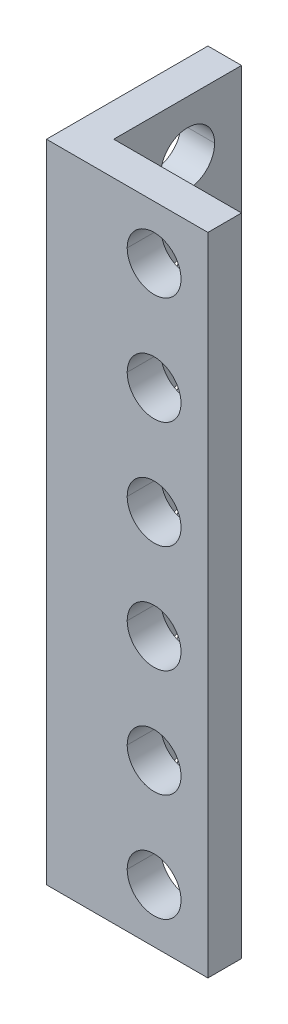
ISO-10303-21;
HEADER;
FILE_DESCRIPTION(('STEP AP214'),'2;1');
FILE_NAME('part.step','',(''),(''),'','','');
FILE_SCHEMA(('AUTOMOTIVE_DESIGN { 1 0 10303 214 1 1 1 1 }'));
ENDSEC;
DATA;
#1=APPLICATION_CONTEXT('core data for automotive mechanical design processes');
#2=APPLICATION_PROTOCOL_DEFINITION('international standard','automotive_design',2000,#1);
#3=PRODUCT_CONTEXT('',#1,'mechanical');
#4=PRODUCT('Part','Part','',(#3));
#5=PRODUCT_RELATED_PRODUCT_CATEGORY('part','',(#4));
#6=PRODUCT_DEFINITION_FORMATION('','',#4);
#7=PRODUCT_DEFINITION_CONTEXT('part definition',#1,'design');
#8=PRODUCT_DEFINITION('design','',#6,#7);
#9=PRODUCT_DEFINITION_SHAPE('','',#8);
#10=(LENGTH_UNIT() NAMED_UNIT(*) SI_UNIT(.MILLI.,.METRE.));
#11=(NAMED_UNIT(*) PLANE_ANGLE_UNIT() SI_UNIT($,.RADIAN.));
#12=(NAMED_UNIT(*) SI_UNIT($,.STERADIAN.) SOLID_ANGLE_UNIT());
#13=UNCERTAINTY_MEASURE_WITH_UNIT(LENGTH_MEASURE(1.E-05),#10,'distance_accuracy_value','');
#14=(GEOMETRIC_REPRESENTATION_CONTEXT(3) GLOBAL_UNCERTAINTY_ASSIGNED_CONTEXT((#13)) GLOBAL_UNIT_ASSIGNED_CONTEXT((#10,
#11,#12)) REPRESENTATION_CONTEXT('',''));
#15=CARTESIAN_POINT('',(0.,0.,0.));
#16=DIRECTION('',(0.,0.,1.));
#17=DIRECTION('',(1.,0.,0.));
#18=AXIS2_PLACEMENT_3D('',#15,#16,#17);
#19=CARTESIAN_POINT('',(12.,44.,-8.));
#20=DIRECTION('',(-1.,0.,0.));
#21=DIRECTION('',(0.,0.,1.));
#22=AXIS2_PLACEMENT_3D('',#19,#20,#21);
#23=CYLINDRICAL_SURFACE('',#22,2.);
#24=DIRECTION('',(-1.,0.,0.));
#25=VECTOR('',#24,1.);
#26=CARTESIAN_POINT('',(12.,44.,-10.));
#27=LINE('',#26,#25);
#28=CARTESIAN_POINT('',(2.5,44.,-10.));
#29=VERTEX_POINT('',#28);
#30=CARTESIAN_POINT('',(0.,44.,-10.));
#31=VERTEX_POINT('',#30);
#32=EDGE_CURVE('E452',#29,#31,#27,.T.);
#33=ORIENTED_EDGE('',*,*,#32,.F.);
#34=CARTESIAN_POINT('',(2.5,44.,-8.));
#35=DIRECTION('',(-1.,0.,0.));
#36=DIRECTION('',(0.,0.,1.));
#37=AXIS2_PLACEMENT_3D('',#34,#35,#36);
#38=CIRCLE('',#37,2.);
#39=CARTESIAN_POINT('',(2.5,44.,-6.));
#40=VERTEX_POINT('',#39);
#41=EDGE_CURVE('E495',#40,#29,#38,.T.);
#42=ORIENTED_EDGE('',*,*,#41,.F.);
#43=DIRECTION('',(-1.,0.,0.));
#44=VECTOR('',#43,1.);
#45=CARTESIAN_POINT('',(12.,44.,-6.));
#46=LINE('',#45,#44);
#47=CARTESIAN_POINT('',(0.,44.,-6.));
#48=VERTEX_POINT('',#47);
#49=EDGE_CURVE('E400',#40,#48,#46,.T.);
#50=ORIENTED_EDGE('',*,*,#49,.T.);
#51=CARTESIAN_POINT('',(0.,44.,-8.));
#52=DIRECTION('',(-1.,0.,0.));
#53=DIRECTION('',(0.,0.,1.));
#54=AXIS2_PLACEMENT_3D('',#51,#52,#53);
#55=CIRCLE('',#54,2.);
#56=EDGE_CURVE('E453',#48,#31,#55,.T.);
#57=ORIENTED_EDGE('',*,*,#56,.T.);
#58=EDGE_LOOP('',(#33,#42,#50,#57));
#59=FACE_BOUND('',#58,.T.);
#60=ADVANCED_FACE('F15',(#59),#23,.F.);
#61=CARTESIAN_POINT('',(12.,36.,-8.));
#62=DIRECTION('',(-1.,0.,0.));
#63=DIRECTION('',(0.,0.,1.));
#64=AXIS2_PLACEMENT_3D('',#61,#62,#63);
#65=CYLINDRICAL_SURFACE('',#64,2.);
#66=DIRECTION('',(-1.,0.,0.));
#67=VECTOR('',#66,1.);
#68=CARTESIAN_POINT('',(12.,36.,-10.));
#69=LINE('',#68,#67);
#70=CARTESIAN_POINT('',(2.5,36.,-10.));
#71=VERTEX_POINT('',#70);
#72=CARTESIAN_POINT('',(0.,36.,-10.));
#73=VERTEX_POINT('',#72);
#74=EDGE_CURVE('E382',#71,#73,#69,.T.);
#75=ORIENTED_EDGE('',*,*,#74,.F.);
#76=CARTESIAN_POINT('',(2.5,36.,-8.));
#77=DIRECTION('',(-1.,0.,0.));
#78=DIRECTION('',(0.,0.,1.));
#79=AXIS2_PLACEMENT_3D('',#76,#77,#78);
#80=CIRCLE('',#79,2.);
#81=CARTESIAN_POINT('',(2.5,36.,-6.));
#82=VERTEX_POINT('',#81);
#83=EDGE_CURVE('E492',#82,#71,#80,.T.);
#84=ORIENTED_EDGE('',*,*,#83,.F.);
#85=DIRECTION('',(-1.,0.,0.));
#86=VECTOR('',#85,1.);
#87=CARTESIAN_POINT('',(12.,36.,-6.));
#88=LINE('',#87,#86);
#89=CARTESIAN_POINT('',(0.,36.,-6.));
#90=VERTEX_POINT('',#89);
#91=EDGE_CURVE('E381',#82,#90,#88,.T.);
#92=ORIENTED_EDGE('',*,*,#91,.T.);
#93=CARTESIAN_POINT('',(0.,36.,-8.));
#94=DIRECTION('',(-1.,0.,0.));
#95=DIRECTION('',(0.,0.,1.));
#96=AXIS2_PLACEMENT_3D('',#93,#94,#95);
#97=CIRCLE('',#96,2.);
#98=EDGE_CURVE('E234',#90,#73,#97,.T.);
#99=ORIENTED_EDGE('',*,*,#98,.T.);
#100=EDGE_LOOP('',(#75,#84,#92,#99));
#101=FACE_BOUND('',#100,.T.);
#102=ADVANCED_FACE('F674',(#101),#65,.F.);
#103=CARTESIAN_POINT('',(12.,28.,-8.));
#104=DIRECTION('',(-1.,0.,0.));
#105=DIRECTION('',(0.,0.,1.));
#106=AXIS2_PLACEMENT_3D('',#103,#104,#105);
#107=CYLINDRICAL_SURFACE('',#106,2.);
#108=DIRECTION('',(-1.,0.,0.));
#109=VECTOR('',#108,1.);
#110=CARTESIAN_POINT('',(12.,28.,-10.));
#111=LINE('',#110,#109);
#112=CARTESIAN_POINT('',(2.5,28.,-10.));
#113=VERTEX_POINT('',#112);
#114=CARTESIAN_POINT('',(0.,28.,-10.));
#115=VERTEX_POINT('',#114);
#116=EDGE_CURVE('E371',#113,#115,#111,.T.);
#117=ORIENTED_EDGE('',*,*,#116,.F.);
#118=CARTESIAN_POINT('',(2.5,28.,-8.));
#119=DIRECTION('',(-1.,0.,0.));
#120=DIRECTION('',(0.,0.,1.));
#121=AXIS2_PLACEMENT_3D('',#118,#119,#120);
#122=CIRCLE('',#121,2.);
#123=CARTESIAN_POINT('',(2.5,28.,-6.));
#124=VERTEX_POINT('',#123);
#125=EDGE_CURVE('E435',#124,#113,#122,.T.);
#126=ORIENTED_EDGE('',*,*,#125,.F.);
#127=DIRECTION('',(-1.,0.,0.));
#128=VECTOR('',#127,1.);
#129=CARTESIAN_POINT('',(12.,28.,-6.));
#130=LINE('',#129,#128);
#131=CARTESIAN_POINT('',(0.,28.,-6.));
#132=VERTEX_POINT('',#131);
#133=EDGE_CURVE('E595',#124,#132,#130,.T.);
#134=ORIENTED_EDGE('',*,*,#133,.T.);
#135=CARTESIAN_POINT('',(0.,28.,-8.));
#136=DIRECTION('',(-1.,0.,0.));
#137=DIRECTION('',(0.,0.,1.));
#138=AXIS2_PLACEMENT_3D('',#135,#136,#137);
#139=CIRCLE('',#138,2.);
#140=EDGE_CURVE('E463',#132,#115,#139,.T.);
#141=ORIENTED_EDGE('',*,*,#140,.T.);
#142=EDGE_LOOP('',(#117,#126,#134,#141));
#143=FACE_BOUND('',#142,.T.);
#144=ADVANCED_FACE('F679',(#143),#107,.F.);
#145=CARTESIAN_POINT('',(12.,20.,-8.));
#146=DIRECTION('',(-1.,0.,0.));
#147=DIRECTION('',(0.,0.,1.));
#148=AXIS2_PLACEMENT_3D('',#145,#146,#147);
#149=CYLINDRICAL_SURFACE('',#148,2.);
#150=DIRECTION('',(-1.,0.,0.));
#151=VECTOR('',#150,1.);
#152=CARTESIAN_POINT('',(12.,20.,-10.));
#153=LINE('',#152,#151);
#154=CARTESIAN_POINT('',(2.5,20.,-10.));
#155=VERTEX_POINT('',#154);
#156=CARTESIAN_POINT('',(0.,20.,-10.));
#157=VERTEX_POINT('',#156);
#158=EDGE_CURVE('E594',#155,#157,#153,.T.);
#159=ORIENTED_EDGE('',*,*,#158,.F.);
#160=CARTESIAN_POINT('',(2.5,20.,-8.));
#161=DIRECTION('',(-1.,0.,0.));
#162=DIRECTION('',(0.,0.,1.));
#163=AXIS2_PLACEMENT_3D('',#160,#161,#162);
#164=CIRCLE('',#163,2.);
#165=CARTESIAN_POINT('',(2.5,20.,-6.));
#166=VERTEX_POINT('',#165);
#167=EDGE_CURVE('E432',#166,#155,#164,.T.);
#168=ORIENTED_EDGE('',*,*,#167,.F.);
#169=DIRECTION('',(-1.,0.,0.));
#170=VECTOR('',#169,1.);
#171=CARTESIAN_POINT('',(12.,20.,-6.));
#172=LINE('',#171,#170);
#173=CARTESIAN_POINT('',(0.,20.,-6.));
#174=VERTEX_POINT('',#173);
#175=EDGE_CURVE('E339',#166,#174,#172,.T.);
#176=ORIENTED_EDGE('',*,*,#175,.T.);
#177=CARTESIAN_POINT('',(0.,20.,-8.));
#178=DIRECTION('',(-1.,0.,0.));
#179=DIRECTION('',(0.,0.,1.));
#180=AXIS2_PLACEMENT_3D('',#177,#178,#179);
#181=CIRCLE('',#180,2.);
#182=EDGE_CURVE('E460',#174,#157,#181,.T.);
#183=ORIENTED_EDGE('',*,*,#182,.T.);
#184=EDGE_LOOP('',(#159,#168,#176,#183));
#185=FACE_BOUND('',#184,.T.);
#186=ADVANCED_FACE('F897',(#185),#149,.F.);
#187=CARTESIAN_POINT('',(12.,12.,-8.));
#188=DIRECTION('',(-1.,0.,0.));
#189=DIRECTION('',(0.,0.,1.));
#190=AXIS2_PLACEMENT_3D('',#187,#188,#189);
#191=CYLINDRICAL_SURFACE('',#190,2.);
#192=DIRECTION('',(-1.,0.,0.));
#193=VECTOR('',#192,1.);
#194=CARTESIAN_POINT('',(12.,12.,-10.));
#195=LINE('',#194,#193);
#196=CARTESIAN_POINT('',(2.5,12.,-10.));
#197=VERTEX_POINT('',#196);
#198=CARTESIAN_POINT('',(0.,12.,-10.));
#199=VERTEX_POINT('',#198);
#200=EDGE_CURVE('E364',#197,#199,#195,.T.);
#201=ORIENTED_EDGE('',*,*,#200,.F.);
#202=CARTESIAN_POINT('',(2.5,12.,-8.));
#203=DIRECTION('',(-1.,0.,0.));
#204=DIRECTION('',(0.,0.,1.));
#205=AXIS2_PLACEMENT_3D('',#202,#203,#204);
#206=CIRCLE('',#205,2.);
#207=CARTESIAN_POINT('',(2.5,12.,-6.));
#208=VERTEX_POINT('',#207);
#209=EDGE_CURVE('E126',#208,#197,#206,.T.);
#210=ORIENTED_EDGE('',*,*,#209,.F.);
#211=DIRECTION('',(-1.,0.,0.));
#212=VECTOR('',#211,1.);
#213=CARTESIAN_POINT('',(12.,12.,-6.));
#214=LINE('',#213,#212);
#215=CARTESIAN_POINT('',(0.,12.,-6.));
#216=VERTEX_POINT('',#215);
#217=EDGE_CURVE('E345',#208,#216,#214,.T.);
#218=ORIENTED_EDGE('',*,*,#217,.T.);
#219=CARTESIAN_POINT('',(0.,12.,-8.));
#220=DIRECTION('',(-1.,0.,0.));
#221=DIRECTION('',(0.,0.,1.));
#222=AXIS2_PLACEMENT_3D('',#219,#220,#221);
#223=CIRCLE('',#222,2.);
#224=EDGE_CURVE('E133',#216,#199,#223,.T.);
#225=ORIENTED_EDGE('',*,*,#224,.T.);
#226=EDGE_LOOP('',(#201,#210,#218,#225));
#227=FACE_BOUND('',#226,.T.);
#228=ADVANCED_FACE('F892',(#227),#191,.F.);
#229=CARTESIAN_POINT('',(8.,44.,-12.));
#230=DIRECTION('',(0.,0.,1.));
#231=DIRECTION('',(1.,0.,0.));
#232=AXIS2_PLACEMENT_3D('',#229,#230,#231);
#233=CYLINDRICAL_SURFACE('',#232,2.);
#234=DIRECTION('',(0.,0.,1.));
#235=VECTOR('',#234,1.);
#236=CARTESIAN_POINT('',(6.,44.,-12.));
#237=LINE('',#236,#235);
#238=CARTESIAN_POINT('',(6.,44.,-2.5));
#239=VERTEX_POINT('',#238);
#240=CARTESIAN_POINT('',(6.,44.,0.));
#241=VERTEX_POINT('',#240);
#242=EDGE_CURVE('E370',#239,#241,#237,.T.);
#243=ORIENTED_EDGE('',*,*,#242,.F.);
#244=CARTESIAN_POINT('',(8.,44.,-2.5));
#245=DIRECTION('',(0.,0.,1.));
#246=DIRECTION('',(-1.,0.,0.));
#247=AXIS2_PLACEMENT_3D('',#244,#245,#246);
#248=CIRCLE('',#247,2.);
#249=CARTESIAN_POINT('',(10.,44.,-2.50000000000004));
#250=VERTEX_POINT('',#249);
#251=EDGE_CURVE('E353',#250,#239,#248,.T.);
#252=ORIENTED_EDGE('',*,*,#251,.F.);
#253=DIRECTION('',(0.,0.,1.));
#254=VECTOR('',#253,1.);
#255=CARTESIAN_POINT('',(10.,44.,-12.));
#256=LINE('',#255,#254);
#257=CARTESIAN_POINT('',(10.,44.,0.));
#258=VERTEX_POINT('',#257);
#259=EDGE_CURVE('E369',#250,#258,#256,.T.);
#260=ORIENTED_EDGE('',*,*,#259,.T.);
#261=CARTESIAN_POINT('',(8.,44.,0.));
#262=DIRECTION('',(0.,0.,-1.));
#263=DIRECTION('',(-1.,0.,0.));
#264=AXIS2_PLACEMENT_3D('',#261,#262,#263);
#265=CIRCLE('',#264,2.);
#266=EDGE_CURVE('E410',#241,#258,#265,.T.);
#267=ORIENTED_EDGE('',*,*,#266,.F.);
#268=EDGE_LOOP('',(#243,#252,#260,#267));
#269=FACE_BOUND('',#268,.T.);
#270=ADVANCED_FACE('F896',(#269),#233,.F.);
#271=CARTESIAN_POINT('',(8.,36.,-12.));
#272=DIRECTION('',(0.,0.,1.));
#273=DIRECTION('',(1.,0.,0.));
#274=AXIS2_PLACEMENT_3D('',#271,#272,#273);
#275=CYLINDRICAL_SURFACE('',#274,2.);
#276=DIRECTION('',(0.,0.,1.));
#277=VECTOR('',#276,1.);
#278=CARTESIAN_POINT('',(6.,36.,-12.));
#279=LINE('',#278,#277);
#280=CARTESIAN_POINT('',(6.,36.,-2.5));
#281=VERTEX_POINT('',#280);
#282=CARTESIAN_POINT('',(6.,36.,0.));
#283=VERTEX_POINT('',#282);
#284=EDGE_CURVE('E540',#281,#283,#279,.T.);
#285=ORIENTED_EDGE('',*,*,#284,.F.);
#286=CARTESIAN_POINT('',(8.,36.,-2.5));
#287=DIRECTION('',(0.,0.,1.));
#288=DIRECTION('',(-1.,0.,0.));
#289=AXIS2_PLACEMENT_3D('',#286,#287,#288);
#290=CIRCLE('',#289,2.);
#291=CARTESIAN_POINT('',(10.,36.,-2.50000000000004));
#292=VERTEX_POINT('',#291);
#293=EDGE_CURVE('E280',#292,#281,#290,.T.);
#294=ORIENTED_EDGE('',*,*,#293,.F.);
#295=DIRECTION('',(0.,0.,1.));
#296=VECTOR('',#295,1.);
#297=CARTESIAN_POINT('',(10.,36.,-12.));
#298=LINE('',#297,#296);
#299=CARTESIAN_POINT('',(10.,36.,0.));
#300=VERTEX_POINT('',#299);
#301=EDGE_CURVE('E468',#292,#300,#298,.T.);
#302=ORIENTED_EDGE('',*,*,#301,.T.);
#303=CARTESIAN_POINT('',(8.,36.,0.));
#304=DIRECTION('',(0.,0.,-1.));
#305=DIRECTION('',(-1.,0.,0.));
#306=AXIS2_PLACEMENT_3D('',#303,#304,#305);
#307=CIRCLE('',#306,2.);
#308=EDGE_CURVE('E448',#283,#300,#307,.T.);
#309=ORIENTED_EDGE('',*,*,#308,.F.);
#310=EDGE_LOOP('',(#285,#294,#302,#309));
#311=FACE_BOUND('',#310,.T.);
#312=ADVANCED_FACE('F658',(#311),#275,.F.);
#313=CARTESIAN_POINT('',(8.,28.,-12.));
#314=DIRECTION('',(0.,0.,1.));
#315=DIRECTION('',(1.,0.,0.));
#316=AXIS2_PLACEMENT_3D('',#313,#314,#315);
#317=CYLINDRICAL_SURFACE('',#316,2.);
#318=DIRECTION('',(0.,0.,1.));
#319=VECTOR('',#318,1.);
#320=CARTESIAN_POINT('',(6.,28.,-12.));
#321=LINE('',#320,#319);
#322=CARTESIAN_POINT('',(6.,28.,-2.5));
#323=VERTEX_POINT('',#322);
#324=CARTESIAN_POINT('',(6.,28.,0.));
#325=VERTEX_POINT('',#324);
#326=EDGE_CURVE('E496',#323,#325,#321,.T.);
#327=ORIENTED_EDGE('',*,*,#326,.F.);
#328=CARTESIAN_POINT('',(8.,28.,-2.5));
#329=DIRECTION('',(0.,0.,1.));
#330=DIRECTION('',(-1.,0.,0.));
#331=AXIS2_PLACEMENT_3D('',#328,#329,#330);
#332=CIRCLE('',#331,2.);
#333=CARTESIAN_POINT('',(10.,28.,-2.50000000000004));
#334=VERTEX_POINT('',#333);
#335=EDGE_CURVE('E357',#334,#323,#332,.T.);
#336=ORIENTED_EDGE('',*,*,#335,.F.);
#337=DIRECTION('',(0.,0.,1.));
#338=VECTOR('',#337,1.);
#339=CARTESIAN_POINT('',(10.,28.,-12.));
#340=LINE('',#339,#338);
#341=CARTESIAN_POINT('',(10.,28.,0.));
#342=VERTEX_POINT('',#341);
#343=EDGE_CURVE('E418',#334,#342,#340,.T.);
#344=ORIENTED_EDGE('',*,*,#343,.T.);
#345=CARTESIAN_POINT('',(8.,28.,0.));
#346=DIRECTION('',(0.,0.,-1.));
#347=DIRECTION('',(-1.,0.,0.));
#348=AXIS2_PLACEMENT_3D('',#345,#346,#347);
#349=CIRCLE('',#348,2.);
#350=EDGE_CURVE('E456',#325,#342,#349,.T.);
#351=ORIENTED_EDGE('',*,*,#350,.F.);
#352=EDGE_LOOP('',(#327,#336,#344,#351));
#353=FACE_BOUND('',#352,.T.);
#354=ADVANCED_FACE('F556',(#353),#317,.F.);
#355=CARTESIAN_POINT('',(8.,20.,-12.));
#356=DIRECTION('',(0.,0.,1.));
#357=DIRECTION('',(1.,0.,0.));
#358=AXIS2_PLACEMENT_3D('',#355,#356,#357);
#359=CYLINDRICAL_SURFACE('',#358,2.);
#360=DIRECTION('',(0.,0.,1.));
#361=VECTOR('',#360,1.);
#362=CARTESIAN_POINT('',(6.,20.,-12.));
#363=LINE('',#362,#361);
#364=CARTESIAN_POINT('',(6.,20.,-2.5));
#365=VERTEX_POINT('',#364);
#366=CARTESIAN_POINT('',(6.,20.,0.));
#367=VERTEX_POINT('',#366);
#368=EDGE_CURVE('E334',#365,#367,#363,.T.);
#369=ORIENTED_EDGE('',*,*,#368,.F.);
#370=CARTESIAN_POINT('',(8.,20.,-2.5));
#371=DIRECTION('',(0.,0.,1.));
#372=DIRECTION('',(-1.,0.,0.));
#373=AXIS2_PLACEMENT_3D('',#370,#371,#372);
#374=CIRCLE('',#373,2.);
#375=CARTESIAN_POINT('',(10.,20.,-2.50000000000004));
#376=VERTEX_POINT('',#375);
#377=EDGE_CURVE('E439',#376,#365,#374,.T.);
#378=ORIENTED_EDGE('',*,*,#377,.F.);
#379=DIRECTION('',(0.,0.,1.));
#380=VECTOR('',#379,1.);
#381=CARTESIAN_POINT('',(10.,20.,-12.));
#382=LINE('',#381,#380);
#383=CARTESIAN_POINT('',(10.,20.,0.));
#384=VERTEX_POINT('',#383);
#385=EDGE_CURVE('E533',#376,#384,#382,.T.);
#386=ORIENTED_EDGE('',*,*,#385,.T.);
#387=CARTESIAN_POINT('',(8.,20.,0.));
#388=DIRECTION('',(0.,0.,-1.));
#389=DIRECTION('',(-1.,0.,0.));
#390=AXIS2_PLACEMENT_3D('',#387,#388,#389);
#391=CIRCLE('',#390,2.);
#392=EDGE_CURVE('E359',#367,#384,#391,.T.);
#393=ORIENTED_EDGE('',*,*,#392,.F.);
#394=EDGE_LOOP('',(#369,#378,#386,#393));
#395=FACE_BOUND('',#394,.T.);
#396=ADVANCED_FACE('F876',(#395),#359,.F.);
#397=CARTESIAN_POINT('',(8.,12.,-12.));
#398=DIRECTION('',(0.,0.,1.));
#399=DIRECTION('',(1.,0.,0.));
#400=AXIS2_PLACEMENT_3D('',#397,#398,#399);
#401=CYLINDRICAL_SURFACE('',#400,2.);
#402=DIRECTION('',(0.,0.,1.));
#403=VECTOR('',#402,1.);
#404=CARTESIAN_POINT('',(6.,12.,-12.));
#405=LINE('',#404,#403);
#406=CARTESIAN_POINT('',(6.,12.,-2.5));
#407=VERTEX_POINT('',#406);
#408=CARTESIAN_POINT('',(6.,12.,0.));
#409=VERTEX_POINT('',#408);
#410=EDGE_CURVE('E605',#407,#409,#405,.T.);
#411=ORIENTED_EDGE('',*,*,#410,.F.);
#412=CARTESIAN_POINT('',(8.,12.,-2.5));
#413=DIRECTION('',(0.,0.,1.));
#414=DIRECTION('',(-1.,0.,0.));
#415=AXIS2_PLACEMENT_3D('',#412,#413,#414);
#416=CIRCLE('',#415,2.);
#417=CARTESIAN_POINT('',(10.,12.,-2.50000000000004));
#418=VERTEX_POINT('',#417);
#419=EDGE_CURVE('E505',#418,#407,#416,.T.);
#420=ORIENTED_EDGE('',*,*,#419,.F.);
#421=DIRECTION('',(0.,0.,1.));
#422=VECTOR('',#421,1.);
#423=CARTESIAN_POINT('',(10.,12.,-12.));
#424=LINE('',#423,#422);
#425=CARTESIAN_POINT('',(10.,12.,0.));
#426=VERTEX_POINT('',#425);
#427=EDGE_CURVE('E328',#418,#426,#424,.T.);
#428=ORIENTED_EDGE('',*,*,#427,.T.);
#429=CARTESIAN_POINT('',(8.,12.,0.));
#430=DIRECTION('',(0.,0.,-1.));
#431=DIRECTION('',(-1.,0.,0.));
#432=AXIS2_PLACEMENT_3D('',#429,#430,#431);
#433=CIRCLE('',#432,2.);
#434=EDGE_CURVE('E309',#409,#426,#433,.T.);
#435=ORIENTED_EDGE('',*,*,#434,.F.);
#436=EDGE_LOOP('',(#411,#420,#428,#435));
#437=FACE_BOUND('',#436,.T.);
#438=ADVANCED_FACE('F989',(#437),#401,.F.);
#439=CARTESIAN_POINT('',(0.,48.,0.));
#440=DIRECTION('',(0.,1.,0.));
#441=DIRECTION('',(1.,0.,0.));
#442=AXIS2_PLACEMENT_3D('',#439,#440,#441);
#443=PLANE('',#442);
#444=DIRECTION('',(1.,0.,0.));
#445=VECTOR('',#444,1.);
#446=CARTESIAN_POINT('',(0.,48.,-2.5));
#447=LINE('',#446,#445);
#448=CARTESIAN_POINT('',(2.5,48.,-2.5));
#449=VERTEX_POINT('',#448);
#450=CARTESIAN_POINT('',(12.,48.,-2.50000000000005));
#451=VERTEX_POINT('',#450);
#452=EDGE_CURVE('E427',#449,#451,#447,.T.);
#453=ORIENTED_EDGE('',*,*,#452,.F.);
#454=DIRECTION('',(0.,0.,-1.));
#455=VECTOR('',#454,1.);
#456=CARTESIAN_POINT('',(2.5,48.,0.));
#457=LINE('',#456,#455);
#458=CARTESIAN_POINT('',(2.5,48.,-12.));
#459=VERTEX_POINT('',#458);
#460=EDGE_CURVE('E506',#449,#459,#457,.T.);
#461=ORIENTED_EDGE('',*,*,#460,.T.);
#462=DIRECTION('',(1.,0.,0.));
#463=VECTOR('',#462,1.);
#464=CARTESIAN_POINT('',(0.,48.,-12.));
#465=LINE('',#464,#463);
#466=CARTESIAN_POINT('',(0.,48.,-12.));
#467=VERTEX_POINT('',#466);
#468=EDGE_CURVE('E332',#467,#459,#465,.T.);
#469=ORIENTED_EDGE('',*,*,#468,.F.);
#470=DIRECTION('',(0.,0.,-1.));
#471=VECTOR('',#470,1.);
#472=CARTESIAN_POINT('',(0.,48.,0.));
#473=LINE('',#472,#471);
#474=CARTESIAN_POINT('',(0.,48.,0.));
#475=VERTEX_POINT('',#474);
#476=EDGE_CURVE('E40',#475,#467,#473,.T.);
#477=ORIENTED_EDGE('',*,*,#476,.F.);
#478=DIRECTION('',(1.,0.,0.));
#479=VECTOR('',#478,1.);
#480=CARTESIAN_POINT('',(0.,48.,0.));
#481=LINE('',#480,#479);
#482=CARTESIAN_POINT('',(12.,48.,0.));
#483=VERTEX_POINT('',#482);
#484=EDGE_CURVE('E386',#475,#483,#481,.T.);
#485=ORIENTED_EDGE('',*,*,#484,.T.);
#486=DIRECTION('',(0.,0.,-1.));
#487=VECTOR('',#486,1.);
#488=CARTESIAN_POINT('',(12.,48.,0.));
#489=LINE('',#488,#487);
#490=EDGE_CURVE('E10',#483,#451,#489,.T.);
#491=ORIENTED_EDGE('',*,*,#490,.T.);
#492=EDGE_LOOP('',(#453,#461,#469,#477,#485,#491));
#493=FACE_BOUND('',#492,.T.);
#494=ADVANCED_FACE('F993',(#493),#443,.T.);
#495=CARTESIAN_POINT('',(8.,4.,-12.));
#496=DIRECTION('',(0.,0.,1.));
#497=DIRECTION('',(1.,0.,0.));
#498=AXIS2_PLACEMENT_3D('',#495,#496,#497);
#499=CYLINDRICAL_SURFACE('',#498,2.);
#500=DIRECTION('',(0.,0.,1.));
#501=VECTOR('',#500,1.);
#502=CARTESIAN_POINT('',(6.,4.,-12.));
#503=LINE('',#502,#501);
#504=CARTESIAN_POINT('',(6.,4.,-2.5));
#505=VERTEX_POINT('',#504);
#506=CARTESIAN_POINT('',(6.,4.,0.));
#507=VERTEX_POINT('',#506);
#508=EDGE_CURVE('E302',#505,#507,#503,.T.);
#509=ORIENTED_EDGE('',*,*,#508,.F.);
#510=CARTESIAN_POINT('',(8.,4.,-2.5));
#511=DIRECTION('',(0.,0.,1.));
#512=DIRECTION('',(-1.,0.,0.));
#513=AXIS2_PLACEMENT_3D('',#510,#511,#512);
#514=CIRCLE('',#513,2.);
#515=CARTESIAN_POINT('',(10.,4.,-2.50000000000004));
#516=VERTEX_POINT('',#515);
#517=EDGE_CURVE('E568',#516,#505,#514,.T.);
#518=ORIENTED_EDGE('',*,*,#517,.F.);
#519=DIRECTION('',(0.,0.,1.));
#520=VECTOR('',#519,1.);
#521=CARTESIAN_POINT('',(10.,4.,-12.));
#522=LINE('',#521,#520);
#523=CARTESIAN_POINT('',(10.,4.,0.));
#524=VERTEX_POINT('',#523);
#525=EDGE_CURVE('E305',#516,#524,#522,.T.);
#526=ORIENTED_EDGE('',*,*,#525,.T.);
#527=CARTESIAN_POINT('',(8.,4.,0.));
#528=DIRECTION('',(0.,0.,-1.));
#529=DIRECTION('',(-1.,0.,0.));
#530=AXIS2_PLACEMENT_3D('',#527,#528,#529);
#531=CIRCLE('',#530,2.);
#532=EDGE_CURVE('E298',#507,#524,#531,.T.);
#533=ORIENTED_EDGE('',*,*,#532,.F.);
#534=EDGE_LOOP('',(#509,#518,#526,#533));
#535=FACE_BOUND('',#534,.T.);
#536=ADVANCED_FACE('F300',(#535),#499,.F.);
#537=CARTESIAN_POINT('',(12.,4.,-8.));
#538=DIRECTION('',(-1.,0.,0.));
#539=DIRECTION('',(0.,0.,1.));
#540=AXIS2_PLACEMENT_3D('',#537,#538,#539);
#541=CYLINDRICAL_SURFACE('',#540,2.);
#542=DIRECTION('',(-1.,0.,0.));
#543=VECTOR('',#542,1.);
#544=CARTESIAN_POINT('',(12.,4.,-10.));
#545=LINE('',#544,#543);
#546=CARTESIAN_POINT('',(2.5,4.,-10.));
#547=VERTEX_POINT('',#546);
#548=CARTESIAN_POINT('',(0.,4.,-10.));
#549=VERTEX_POINT('',#548);
#550=EDGE_CURVE('E399',#547,#549,#545,.T.);
#551=ORIENTED_EDGE('',*,*,#550,.F.);
#552=CARTESIAN_POINT('',(2.5,4.,-8.));
#553=DIRECTION('',(-1.,0.,0.));
#554=DIRECTION('',(0.,0.,1.));
#555=AXIS2_PLACEMENT_3D('',#552,#553,#554);
#556=CIRCLE('',#555,2.);
#557=CARTESIAN_POINT('',(2.5,4.,-6.));
#558=VERTEX_POINT('',#557);
#559=EDGE_CURVE('E436',#558,#547,#556,.T.);
#560=ORIENTED_EDGE('',*,*,#559,.F.);
#561=DIRECTION('',(-1.,0.,0.));
#562=VECTOR('',#561,1.);
#563=CARTESIAN_POINT('',(12.,4.,-6.));
#564=LINE('',#563,#562);
#565=CARTESIAN_POINT('',(0.,4.,-6.));
#566=VERTEX_POINT('',#565);
#567=EDGE_CURVE('E387',#558,#566,#564,.T.);
#568=ORIENTED_EDGE('',*,*,#567,.T.);
#569=CARTESIAN_POINT('',(0.,4.,-8.));
#570=DIRECTION('',(-1.,0.,0.));
#571=DIRECTION('',(0.,0.,1.));
#572=AXIS2_PLACEMENT_3D('',#569,#570,#571);
#573=CIRCLE('',#572,2.);
#574=EDGE_CURVE('E464',#566,#549,#573,.T.);
#575=ORIENTED_EDGE('',*,*,#574,.T.);
#576=EDGE_LOOP('',(#551,#560,#568,#575));
#577=FACE_BOUND('',#576,.T.);
#578=ADVANCED_FACE('F963',(#577),#541,.F.);
#579=CARTESIAN_POINT('',(0.,0.,0.));
#580=DIRECTION('',(0.,1.,0.));
#581=DIRECTION('',(1.,0.,0.));
#582=AXIS2_PLACEMENT_3D('',#579,#580,#581);
#583=PLANE('',#582);
#584=DIRECTION('',(1.,0.,0.));
#585=VECTOR('',#584,1.);
#586=CARTESIAN_POINT('',(0.,0.,-2.5));
#587=LINE('',#586,#585);
#588=CARTESIAN_POINT('',(2.5,0.,-2.5));
#589=VERTEX_POINT('',#588);
#590=CARTESIAN_POINT('',(12.,0.,-2.50000000000005));
#591=VERTEX_POINT('',#590);
#592=EDGE_CURVE('E391',#589,#591,#587,.T.);
#593=ORIENTED_EDGE('',*,*,#592,.T.);
#594=DIRECTION('',(0.,0.,-1.));
#595=VECTOR('',#594,1.);
#596=CARTESIAN_POINT('',(12.,0.,0.));
#597=LINE('',#596,#595);
#598=CARTESIAN_POINT('',(12.,0.,0.));
#599=VERTEX_POINT('',#598);
#600=EDGE_CURVE('E25',#599,#591,#597,.T.);
#601=ORIENTED_EDGE('',*,*,#600,.F.);
#602=DIRECTION('',(1.,0.,0.));
#603=VECTOR('',#602,1.);
#604=CARTESIAN_POINT('',(0.,0.,0.));
#605=LINE('',#604,#603);
#606=CARTESIAN_POINT('',(0.,0.,0.));
#607=VERTEX_POINT('',#606);
#608=EDGE_CURVE('E356',#607,#599,#605,.T.);
#609=ORIENTED_EDGE('',*,*,#608,.F.);
#610=DIRECTION('',(0.,0.,-1.));
#611=VECTOR('',#610,1.);
#612=CARTESIAN_POINT('',(0.,0.,0.));
#613=LINE('',#612,#611);
#614=CARTESIAN_POINT('',(0.,0.,-12.));
#615=VERTEX_POINT('',#614);
#616=EDGE_CURVE('E475',#607,#615,#613,.T.);
#617=ORIENTED_EDGE('',*,*,#616,.T.);
#618=DIRECTION('',(1.,0.,0.));
#619=VECTOR('',#618,1.);
#620=CARTESIAN_POINT('',(0.,0.,-12.));
#621=LINE('',#620,#619);
#622=CARTESIAN_POINT('',(2.5,0.,-12.));
#623=VERTEX_POINT('',#622);
#624=EDGE_CURVE('E413',#615,#623,#621,.T.);
#625=ORIENTED_EDGE('',*,*,#624,.T.);
#626=DIRECTION('',(0.,0.,-1.));
#627=VECTOR('',#626,1.);
#628=CARTESIAN_POINT('',(2.5,0.,0.));
#629=LINE('',#628,#627);
#630=EDGE_CURVE('E406',#589,#623,#629,.T.);
#631=ORIENTED_EDGE('',*,*,#630,.F.);
#632=EDGE_LOOP('',(#593,#601,#609,#617,#625,#631));
#633=FACE_BOUND('',#632,.T.);
#634=ADVANCED_FACE('F958',(#633),#583,.F.);
#635=CARTESIAN_POINT('',(12.,8.,0.));
#636=DIRECTION('',(-1.,0.,0.));
#637=DIRECTION('',(0.,1.,0.));
#638=AXIS2_PLACEMENT_3D('',#635,#636,#637);
#639=PLANE('',#638);
#640=ORIENTED_EDGE('',*,*,#600,.T.);
#641=DIRECTION('',(0.,-1.,0.));
#642=VECTOR('',#641,1.);
#643=CARTESIAN_POINT('',(12.,8.,-2.50000000000005));
#644=LINE('',#643,#642);
#645=EDGE_CURVE('E423',#451,#591,#644,.T.);
#646=ORIENTED_EDGE('',*,*,#645,.F.);
#647=ORIENTED_EDGE('',*,*,#490,.F.);
#648=DIRECTION('',(0.,-1.,0.));
#649=VECTOR('',#648,1.);
#650=CARTESIAN_POINT('',(12.,8.,0.));
#651=LINE('',#650,#649);
#652=EDGE_CURVE('E431',#483,#599,#651,.T.);
#653=ORIENTED_EDGE('',*,*,#652,.T.);
#654=EDGE_LOOP('',(#640,#646,#647,#653));
#655=FACE_BOUND('',#654,.T.);
#656=ADVANCED_FACE('F962',(#655),#639,.F.);
#657=CARTESIAN_POINT('',(0.,8.,0.));
#658=DIRECTION('',(-1.,0.,0.));
#659=DIRECTION('',(0.,0.,1.));
#660=AXIS2_PLACEMENT_3D('',#657,#658,#659);
#661=PLANE('',#660);
#662=ORIENTED_EDGE('',*,*,#56,.F.);
#663=CARTESIAN_POINT('',(0.,44.,-8.));
#664=DIRECTION('',(-1.,0.,0.));
#665=DIRECTION('',(0.,0.,1.));
#666=AXIS2_PLACEMENT_3D('',#663,#664,#665);
#667=CIRCLE('',#666,2.);
#668=EDGE_CURVE('E405',#31,#48,#667,.T.);
#669=ORIENTED_EDGE('',*,*,#668,.F.);
#670=EDGE_LOOP('',(#662,#669));
#671=FACE_BOUND('',#670,.T.);
#672=ORIENTED_EDGE('',*,*,#98,.F.);
#673=CARTESIAN_POINT('',(0.,36.,-8.));
#674=DIRECTION('',(-1.,0.,0.));
#675=DIRECTION('',(0.,0.,1.));
#676=AXIS2_PLACEMENT_3D('',#673,#674,#675);
#677=CIRCLE('',#676,2.);
#678=EDGE_CURVE('E377',#73,#90,#677,.T.);
#679=ORIENTED_EDGE('',*,*,#678,.F.);
#680=EDGE_LOOP('',(#672,#679));
#681=FACE_BOUND('',#680,.T.);
#682=ORIENTED_EDGE('',*,*,#140,.F.);
#683=CARTESIAN_POINT('',(0.,28.,-8.));
#684=DIRECTION('',(-1.,0.,0.));
#685=DIRECTION('',(0.,0.,1.));
#686=AXIS2_PLACEMENT_3D('',#683,#684,#685);
#687=CIRCLE('',#686,2.);
#688=EDGE_CURVE('E375',#115,#132,#687,.T.);
#689=ORIENTED_EDGE('',*,*,#688,.F.);
#690=EDGE_LOOP('',(#682,#689));
#691=FACE_BOUND('',#690,.T.);
#692=ORIENTED_EDGE('',*,*,#182,.F.);
#693=CARTESIAN_POINT('',(0.,20.,-8.));
#694=DIRECTION('',(-1.,0.,0.));
#695=DIRECTION('',(0.,0.,1.));
#696=AXIS2_PLACEMENT_3D('',#693,#694,#695);
#697=CIRCLE('',#696,2.);
#698=EDGE_CURVE('E344',#157,#174,#697,.T.);
#699=ORIENTED_EDGE('',*,*,#698,.F.);
#700=EDGE_LOOP('',(#692,#699));
#701=FACE_BOUND('',#700,.T.);
#702=ORIENTED_EDGE('',*,*,#574,.F.);
#703=CARTESIAN_POINT('',(0.,4.,-8.));
#704=DIRECTION('',(-1.,0.,0.));
#705=DIRECTION('',(0.,0.,1.));
#706=AXIS2_PLACEMENT_3D('',#703,#704,#705);
#707=CIRCLE('',#706,2.);
#708=EDGE_CURVE('E392',#549,#566,#707,.T.);
#709=ORIENTED_EDGE('',*,*,#708,.F.);
#710=EDGE_LOOP('',(#702,#709));
#711=FACE_BOUND('',#710,.T.);
#712=ORIENTED_EDGE('',*,*,#224,.F.);
#713=CARTESIAN_POINT('',(0.,12.,-8.));
#714=DIRECTION('',(-1.,0.,0.));
#715=DIRECTION('',(0.,0.,1.));
#716=AXIS2_PLACEMENT_3D('',#713,#714,#715);
#717=CIRCLE('',#716,2.);
#718=EDGE_CURVE('E349',#199,#216,#717,.T.);
#719=ORIENTED_EDGE('',*,*,#718,.F.);
#720=EDGE_LOOP('',(#712,#719));
#721=FACE_BOUND('',#720,.T.);
#722=ORIENTED_EDGE('',*,*,#616,.F.);
#723=DIRECTION('',(0.,-1.,0.));
#724=VECTOR('',#723,1.);
#725=CARTESIAN_POINT('',(0.,8.,0.));
#726=LINE('',#725,#724);
#727=EDGE_CURVE('E310',#475,#607,#726,.T.);
#728=ORIENTED_EDGE('',*,*,#727,.F.);
#729=ORIENTED_EDGE('',*,*,#476,.T.);
#730=DIRECTION('',(0.,-1.,0.));
#731=VECTOR('',#730,1.);
#732=CARTESIAN_POINT('',(0.,8.,-12.));
#733=LINE('',#732,#731);
#734=EDGE_CURVE('E411',#467,#615,#733,.T.);
#735=ORIENTED_EDGE('',*,*,#734,.T.);
#736=EDGE_LOOP('',(#722,#728,#729,#735));
#737=FACE_BOUND('',#736,.T.);
#738=ADVANCED_FACE('F1016',(#671,#681,#691,#701,#711,#721,#737),#661,.T.);
#739=CARTESIAN_POINT('',(0.,8.,-12.));
#740=DIRECTION('',(0.,0.,-1.));
#741=DIRECTION('',(0.,-1.,0.));
#742=AXIS2_PLACEMENT_3D('',#739,#740,#741);
#743=PLANE('',#742);
#744=ORIENTED_EDGE('',*,*,#624,.F.);
#745=ORIENTED_EDGE('',*,*,#734,.F.);
#746=ORIENTED_EDGE('',*,*,#468,.T.);
#747=DIRECTION('',(0.,-1.,0.));
#748=VECTOR('',#747,1.);
#749=CARTESIAN_POINT('',(2.5,8.,-12.));
#750=LINE('',#749,#748);
#751=EDGE_CURVE('E18',#459,#623,#750,.T.);
#752=ORIENTED_EDGE('',*,*,#751,.T.);
#753=EDGE_LOOP('',(#744,#745,#746,#752));
#754=FACE_BOUND('',#753,.T.);
#755=ADVANCED_FACE('F668',(#754),#743,.T.);
#756=CARTESIAN_POINT('',(2.5,8.,0.));
#757=DIRECTION('',(-1.,0.,0.));
#758=DIRECTION('',(0.,0.,1.));
#759=AXIS2_PLACEMENT_3D('',#756,#757,#758);
#760=PLANE('',#759);
#761=ORIENTED_EDGE('',*,*,#41,.T.);
#762=CARTESIAN_POINT('',(2.5,44.,-8.));
#763=DIRECTION('',(-1.,0.,0.));
#764=DIRECTION('',(0.,0.,1.));
#765=AXIS2_PLACEMENT_3D('',#762,#763,#764);
#766=CIRCLE('',#765,2.);
#767=EDGE_CURVE('E491',#29,#40,#766,.T.);
#768=ORIENTED_EDGE('',*,*,#767,.T.);
#769=EDGE_LOOP('',(#761,#768));
#770=FACE_BOUND('',#769,.T.);
#771=ORIENTED_EDGE('',*,*,#83,.T.);
#772=CARTESIAN_POINT('',(2.5,36.,-8.));
#773=DIRECTION('',(-1.,0.,0.));
#774=DIRECTION('',(0.,0.,1.));
#775=AXIS2_PLACEMENT_3D('',#772,#773,#774);
#776=CIRCLE('',#775,2.);
#777=EDGE_CURVE('E404',#71,#82,#776,.T.);
#778=ORIENTED_EDGE('',*,*,#777,.T.);
#779=EDGE_LOOP('',(#771,#778));
#780=FACE_BOUND('',#779,.T.);
#781=ORIENTED_EDGE('',*,*,#125,.T.);
#782=CARTESIAN_POINT('',(2.5,28.,-8.));
#783=DIRECTION('',(-1.,0.,0.));
#784=DIRECTION('',(0.,0.,1.));
#785=AXIS2_PLACEMENT_3D('',#782,#783,#784);
#786=CIRCLE('',#785,2.);
#787=EDGE_CURVE('E376',#113,#124,#786,.T.);
#788=ORIENTED_EDGE('',*,*,#787,.T.);
#789=EDGE_LOOP('',(#781,#788));
#790=FACE_BOUND('',#789,.T.);
#791=ORIENTED_EDGE('',*,*,#167,.T.);
#792=CARTESIAN_POINT('',(2.5,20.,-8.));
#793=DIRECTION('',(-1.,0.,0.));
#794=DIRECTION('',(0.,0.,1.));
#795=AXIS2_PLACEMENT_3D('',#792,#793,#794);
#796=CIRCLE('',#795,2.);
#797=EDGE_CURVE('E599',#155,#166,#796,.T.);
#798=ORIENTED_EDGE('',*,*,#797,.T.);
#799=EDGE_LOOP('',(#791,#798));
#800=FACE_BOUND('',#799,.T.);
#801=ORIENTED_EDGE('',*,*,#559,.T.);
#802=CARTESIAN_POINT('',(2.5,4.,-8.));
#803=DIRECTION('',(-1.,0.,0.));
#804=DIRECTION('',(0.,0.,1.));
#805=AXIS2_PLACEMENT_3D('',#802,#803,#804);
#806=CIRCLE('',#805,2.);
#807=EDGE_CURVE('E352',#547,#558,#806,.T.);
#808=ORIENTED_EDGE('',*,*,#807,.T.);
#809=EDGE_LOOP('',(#801,#808));
#810=FACE_BOUND('',#809,.T.);
#811=ORIENTED_EDGE('',*,*,#209,.T.);
#812=CARTESIAN_POINT('',(2.5,12.,-8.));
#813=DIRECTION('',(-1.,0.,0.));
#814=DIRECTION('',(0.,0.,1.));
#815=AXIS2_PLACEMENT_3D('',#812,#813,#814);
#816=CIRCLE('',#815,2.);
#817=EDGE_CURVE('E343',#197,#208,#816,.T.);
#818=ORIENTED_EDGE('',*,*,#817,.T.);
#819=EDGE_LOOP('',(#811,#818));
#820=FACE_BOUND('',#819,.T.);
#821=ORIENTED_EDGE('',*,*,#630,.T.);
#822=ORIENTED_EDGE('',*,*,#751,.F.);
#823=ORIENTED_EDGE('',*,*,#460,.F.);
#824=DIRECTION('',(0.,-1.,0.));
#825=VECTOR('',#824,1.);
#826=CARTESIAN_POINT('',(2.5,8.,-2.5));
#827=LINE('',#826,#825);
#828=EDGE_CURVE('E484',#449,#589,#827,.T.);
#829=ORIENTED_EDGE('',*,*,#828,.T.);
#830=EDGE_LOOP('',(#821,#822,#823,#829));
#831=FACE_BOUND('',#830,.T.);
#832=ADVANCED_FACE('F661',(#770,#780,#790,#800,#810,#820,#831),#760,.F.);
#833=CARTESIAN_POINT('',(0.,8.,0.));
#834=DIRECTION('',(0.,0.,-1.));
#835=DIRECTION('',(-1.,0.,0.));
#836=AXIS2_PLACEMENT_3D('',#833,#834,#835);
#837=PLANE('',#836);
#838=CARTESIAN_POINT('',(8.,44.,0.));
#839=DIRECTION('',(0.,0.,-1.));
#840=DIRECTION('',(-1.,0.,0.));
#841=AXIS2_PLACEMENT_3D('',#838,#839,#840);
#842=CIRCLE('',#841,2.);
#843=EDGE_CURVE('E365',#258,#241,#842,.T.);
#844=ORIENTED_EDGE('',*,*,#843,.T.);
#845=ORIENTED_EDGE('',*,*,#266,.T.);
#846=EDGE_LOOP('',(#844,#845));
#847=FACE_BOUND('',#846,.T.);
#848=CARTESIAN_POINT('',(8.,36.,0.));
#849=DIRECTION('',(0.,0.,-1.));
#850=DIRECTION('',(-1.,0.,0.));
#851=AXIS2_PLACEMENT_3D('',#848,#849,#850);
#852=CIRCLE('',#851,2.);
#853=EDGE_CURVE('E472',#300,#283,#852,.T.);
#854=ORIENTED_EDGE('',*,*,#853,.T.);
#855=ORIENTED_EDGE('',*,*,#308,.T.);
#856=EDGE_LOOP('',(#854,#855));
#857=FACE_BOUND('',#856,.T.);
#858=CARTESIAN_POINT('',(8.,28.,0.));
#859=DIRECTION('',(0.,0.,-1.));
#860=DIRECTION('',(-1.,0.,0.));
#861=AXIS2_PLACEMENT_3D('',#858,#859,#860);
#862=CIRCLE('',#861,2.);
#863=EDGE_CURVE('E422',#342,#325,#862,.T.);
#864=ORIENTED_EDGE('',*,*,#863,.T.);
#865=ORIENTED_EDGE('',*,*,#350,.T.);
#866=EDGE_LOOP('',(#864,#865));
#867=FACE_BOUND('',#866,.T.);
#868=CARTESIAN_POINT('',(8.,20.,0.));
#869=DIRECTION('',(0.,0.,-1.));
#870=DIRECTION('',(-1.,0.,0.));
#871=AXIS2_PLACEMENT_3D('',#868,#869,#870);
#872=CIRCLE('',#871,2.);
#873=EDGE_CURVE('E337',#384,#367,#872,.T.);
#874=ORIENTED_EDGE('',*,*,#873,.T.);
#875=ORIENTED_EDGE('',*,*,#392,.T.);
#876=EDGE_LOOP('',(#874,#875));
#877=FACE_BOUND('',#876,.T.);
#878=CARTESIAN_POINT('',(8.,12.,0.));
#879=DIRECTION('',(0.,0.,-1.));
#880=DIRECTION('',(-1.,0.,0.));
#881=AXIS2_PLACEMENT_3D('',#878,#879,#880);
#882=CIRCLE('',#881,2.);
#883=EDGE_CURVE('E609',#426,#409,#882,.T.);
#884=ORIENTED_EDGE('',*,*,#883,.T.);
#885=ORIENTED_EDGE('',*,*,#434,.T.);
#886=EDGE_LOOP('',(#884,#885));
#887=FACE_BOUND('',#886,.T.);
#888=CARTESIAN_POINT('',(8.,4.,0.));
#889=DIRECTION('',(0.,0.,-1.));
#890=DIRECTION('',(-1.,0.,0.));
#891=AXIS2_PLACEMENT_3D('',#888,#889,#890);
#892=CIRCLE('',#891,2.);
#893=EDGE_CURVE('E312',#524,#507,#892,.T.);
#894=ORIENTED_EDGE('',*,*,#893,.T.);
#895=ORIENTED_EDGE('',*,*,#532,.T.);
#896=EDGE_LOOP('',(#894,#895));
#897=FACE_BOUND('',#896,.T.);
#898=ORIENTED_EDGE('',*,*,#608,.T.);
#899=ORIENTED_EDGE('',*,*,#652,.F.);
#900=ORIENTED_EDGE('',*,*,#484,.F.);
#901=ORIENTED_EDGE('',*,*,#727,.T.);
#902=EDGE_LOOP('',(#898,#899,#900,#901));
#903=FACE_BOUND('',#902,.T.);
#904=ADVANCED_FACE('F313',(#847,#857,#867,#877,#887,#897,#903),#837,.F.);
#905=CARTESIAN_POINT('',(0.,8.,-2.5));
#906=DIRECTION('',(0.,0.,-1.));
#907=DIRECTION('',(-1.,0.,0.));
#908=AXIS2_PLACEMENT_3D('',#905,#906,#907);
#909=PLANE('',#908);
#910=ORIENTED_EDGE('',*,*,#251,.T.);
#911=CARTESIAN_POINT('',(8.,44.,-2.5));
#912=DIRECTION('',(0.,0.,1.));
#913=DIRECTION('',(-1.,0.,0.));
#914=AXIS2_PLACEMENT_3D('',#911,#912,#913);
#915=CIRCLE('',#914,2.);
#916=EDGE_CURVE('E348',#239,#250,#915,.T.);
#917=ORIENTED_EDGE('',*,*,#916,.T.);
#918=EDGE_LOOP('',(#910,#917));
#919=FACE_BOUND('',#918,.T.);
#920=ORIENTED_EDGE('',*,*,#335,.T.);
#921=CARTESIAN_POINT('',(8.,28.,-2.5));
#922=DIRECTION('',(0.,0.,1.));
#923=DIRECTION('',(-1.,0.,0.));
#924=AXIS2_PLACEMENT_3D('',#921,#922,#923);
#925=CIRCLE('',#924,2.);
#926=EDGE_CURVE('E471',#323,#334,#925,.T.);
#927=ORIENTED_EDGE('',*,*,#926,.T.);
#928=EDGE_LOOP('',(#920,#927));
#929=FACE_BOUND('',#928,.T.);
#930=ORIENTED_EDGE('',*,*,#419,.T.);
#931=CARTESIAN_POINT('',(8.,12.,-2.5));
#932=DIRECTION('',(0.,0.,1.));
#933=DIRECTION('',(-1.,0.,0.));
#934=AXIS2_PLACEMENT_3D('',#931,#932,#933);
#935=CIRCLE('',#934,2.);
#936=EDGE_CURVE('E586',#407,#418,#935,.T.);
#937=ORIENTED_EDGE('',*,*,#936,.T.);
#938=EDGE_LOOP('',(#930,#937));
#939=FACE_BOUND('',#938,.T.);
#940=ORIENTED_EDGE('',*,*,#517,.T.);
#941=CARTESIAN_POINT('',(8.,4.,-2.5));
#942=DIRECTION('',(0.,0.,1.));
#943=DIRECTION('',(-1.,0.,0.));
#944=AXIS2_PLACEMENT_3D('',#941,#942,#943);
#945=CIRCLE('',#944,2.);
#946=EDGE_CURVE('E320',#505,#516,#945,.T.);
#947=ORIENTED_EDGE('',*,*,#946,.T.);
#948=EDGE_LOOP('',(#940,#947));
#949=FACE_BOUND('',#948,.T.);
#950=ORIENTED_EDGE('',*,*,#377,.T.);
#951=CARTESIAN_POINT('',(8.,20.,-2.5));
#952=DIRECTION('',(0.,0.,1.));
#953=DIRECTION('',(-1.,0.,0.));
#954=AXIS2_PLACEMENT_3D('',#951,#952,#953);
#955=CIRCLE('',#954,2.);
#956=EDGE_CURVE('E338',#365,#376,#955,.T.);
#957=ORIENTED_EDGE('',*,*,#956,.T.);
#958=EDGE_LOOP('',(#950,#957));
#959=FACE_BOUND('',#958,.T.);
#960=ORIENTED_EDGE('',*,*,#293,.T.);
#961=CARTESIAN_POINT('',(8.,36.,-2.5));
#962=DIRECTION('',(0.,0.,1.));
#963=DIRECTION('',(-1.,0.,0.));
#964=AXIS2_PLACEMENT_3D('',#961,#962,#963);
#965=CIRCLE('',#964,2.);
#966=EDGE_CURVE('E481',#281,#292,#965,.T.);
#967=ORIENTED_EDGE('',*,*,#966,.T.);
#968=EDGE_LOOP('',(#960,#967));
#969=FACE_BOUND('',#968,.T.);
#970=ORIENTED_EDGE('',*,*,#592,.F.);
#971=ORIENTED_EDGE('',*,*,#828,.F.);
#972=ORIENTED_EDGE('',*,*,#452,.T.);
#973=ORIENTED_EDGE('',*,*,#645,.T.);
#974=EDGE_LOOP('',(#970,#971,#972,#973));
#975=FACE_BOUND('',#974,.T.);
#976=ADVANCED_FACE('F558',(#919,#929,#939,#949,#959,#969,#975),#909,.T.);
#977=CARTESIAN_POINT('',(12.,4.,-8.));
#978=DIRECTION('',(-1.,0.,0.));
#979=DIRECTION('',(0.,0.,1.));
#980=AXIS2_PLACEMENT_3D('',#977,#978,#979);
#981=CYLINDRICAL_SURFACE('',#980,2.);
#982=ORIENTED_EDGE('',*,*,#807,.F.);
#983=ORIENTED_EDGE('',*,*,#550,.T.);
#984=ORIENTED_EDGE('',*,*,#708,.T.);
#985=ORIENTED_EDGE('',*,*,#567,.F.);
#986=EDGE_LOOP('',(#982,#983,#984,#985));
#987=FACE_BOUND('',#986,.T.);
#988=ADVANCED_FACE('F561',(#987),#981,.F.);
#989=CARTESIAN_POINT('',(8.,4.,-12.));
#990=DIRECTION('',(0.,0.,1.));
#991=DIRECTION('',(1.,0.,0.));
#992=AXIS2_PLACEMENT_3D('',#989,#990,#991);
#993=CYLINDRICAL_SURFACE('',#992,2.);
#994=ORIENTED_EDGE('',*,*,#946,.F.);
#995=ORIENTED_EDGE('',*,*,#508,.T.);
#996=ORIENTED_EDGE('',*,*,#893,.F.);
#997=ORIENTED_EDGE('',*,*,#525,.F.);
#998=EDGE_LOOP('',(#994,#995,#996,#997));
#999=FACE_BOUND('',#998,.T.);
#1000=ADVANCED_FACE('F318',(#999),#993,.F.);
#1001=CARTESIAN_POINT('',(8.,12.,-12.));
#1002=DIRECTION('',(0.,0.,1.));
#1003=DIRECTION('',(1.,0.,0.));
#1004=AXIS2_PLACEMENT_3D('',#1001,#1002,#1003);
#1005=CYLINDRICAL_SURFACE('',#1004,2.);
#1006=ORIENTED_EDGE('',*,*,#936,.F.);
#1007=ORIENTED_EDGE('',*,*,#410,.T.);
#1008=ORIENTED_EDGE('',*,*,#883,.F.);
#1009=ORIENTED_EDGE('',*,*,#427,.F.);
#1010=EDGE_LOOP('',(#1006,#1007,#1008,#1009));
#1011=FACE_BOUND('',#1010,.T.);
#1012=ADVANCED_FACE('F979',(#1011),#1005,.F.);
#1013=CARTESIAN_POINT('',(8.,20.,-12.));
#1014=DIRECTION('',(0.,0.,1.));
#1015=DIRECTION('',(1.,0.,0.));
#1016=AXIS2_PLACEMENT_3D('',#1013,#1014,#1015);
#1017=CYLINDRICAL_SURFACE('',#1016,2.);
#1018=ORIENTED_EDGE('',*,*,#956,.F.);
#1019=ORIENTED_EDGE('',*,*,#368,.T.);
#1020=ORIENTED_EDGE('',*,*,#873,.F.);
#1021=ORIENTED_EDGE('',*,*,#385,.F.);
#1022=EDGE_LOOP('',(#1018,#1019,#1020,#1021));
#1023=FACE_BOUND('',#1022,.T.);
#1024=ADVANCED_FACE('F910',(#1023),#1017,.F.);
#1025=CARTESIAN_POINT('',(8.,28.,-12.));
#1026=DIRECTION('',(0.,0.,1.));
#1027=DIRECTION('',(1.,0.,0.));
#1028=AXIS2_PLACEMENT_3D('',#1025,#1026,#1027);
#1029=CYLINDRICAL_SURFACE('',#1028,2.);
#1030=ORIENTED_EDGE('',*,*,#926,.F.);
#1031=ORIENTED_EDGE('',*,*,#326,.T.);
#1032=ORIENTED_EDGE('',*,*,#863,.F.);
#1033=ORIENTED_EDGE('',*,*,#343,.F.);
#1034=EDGE_LOOP('',(#1030,#1031,#1032,#1033));
#1035=FACE_BOUND('',#1034,.T.);
#1036=ADVANCED_FACE('F554',(#1035),#1029,.F.);
#1037=CARTESIAN_POINT('',(8.,36.,-12.));
#1038=DIRECTION('',(0.,0.,1.));
#1039=DIRECTION('',(1.,0.,0.));
#1040=AXIS2_PLACEMENT_3D('',#1037,#1038,#1039);
#1041=CYLINDRICAL_SURFACE('',#1040,2.);
#1042=ORIENTED_EDGE('',*,*,#966,.F.);
#1043=ORIENTED_EDGE('',*,*,#284,.T.);
#1044=ORIENTED_EDGE('',*,*,#853,.F.);
#1045=ORIENTED_EDGE('',*,*,#301,.F.);
#1046=EDGE_LOOP('',(#1042,#1043,#1044,#1045));
#1047=FACE_BOUND('',#1046,.T.);
#1048=ADVANCED_FACE('F657',(#1047),#1041,.F.);
#1049=CARTESIAN_POINT('',(8.,44.,-12.));
#1050=DIRECTION('',(0.,0.,1.));
#1051=DIRECTION('',(1.,0.,0.));
#1052=AXIS2_PLACEMENT_3D('',#1049,#1050,#1051);
#1053=CYLINDRICAL_SURFACE('',#1052,2.);
#1054=ORIENTED_EDGE('',*,*,#916,.F.);
#1055=ORIENTED_EDGE('',*,*,#242,.T.);
#1056=ORIENTED_EDGE('',*,*,#843,.F.);
#1057=ORIENTED_EDGE('',*,*,#259,.F.);
#1058=EDGE_LOOP('',(#1054,#1055,#1056,#1057));
#1059=FACE_BOUND('',#1058,.T.);
#1060=ADVANCED_FACE('F942',(#1059),#1053,.F.);
#1061=CARTESIAN_POINT('',(12.,12.,-8.));
#1062=DIRECTION('',(-1.,0.,0.));
#1063=DIRECTION('',(0.,0.,1.));
#1064=AXIS2_PLACEMENT_3D('',#1061,#1062,#1063);
#1065=CYLINDRICAL_SURFACE('',#1064,2.);
#1066=ORIENTED_EDGE('',*,*,#817,.F.);
#1067=ORIENTED_EDGE('',*,*,#200,.T.);
#1068=ORIENTED_EDGE('',*,*,#718,.T.);
#1069=ORIENTED_EDGE('',*,*,#217,.F.);
#1070=EDGE_LOOP('',(#1066,#1067,#1068,#1069));
#1071=FACE_BOUND('',#1070,.T.);
#1072=ADVANCED_FACE('F918',(#1071),#1065,.F.);
#1073=CARTESIAN_POINT('',(12.,20.,-8.));
#1074=DIRECTION('',(-1.,0.,0.));
#1075=DIRECTION('',(0.,0.,1.));
#1076=AXIS2_PLACEMENT_3D('',#1073,#1074,#1075);
#1077=CYLINDRICAL_SURFACE('',#1076,2.);
#1078=ORIENTED_EDGE('',*,*,#797,.F.);
#1079=ORIENTED_EDGE('',*,*,#158,.T.);
#1080=ORIENTED_EDGE('',*,*,#698,.T.);
#1081=ORIENTED_EDGE('',*,*,#175,.F.);
#1082=EDGE_LOOP('',(#1078,#1079,#1080,#1081));
#1083=FACE_BOUND('',#1082,.T.);
#1084=ADVANCED_FACE('F886',(#1083),#1077,.F.);
#1085=CARTESIAN_POINT('',(12.,28.,-8.));
#1086=DIRECTION('',(-1.,0.,0.));
#1087=DIRECTION('',(0.,0.,1.));
#1088=AXIS2_PLACEMENT_3D('',#1085,#1086,#1087);
#1089=CYLINDRICAL_SURFACE('',#1088,2.);
#1090=ORIENTED_EDGE('',*,*,#787,.F.);
#1091=ORIENTED_EDGE('',*,*,#116,.T.);
#1092=ORIENTED_EDGE('',*,*,#688,.T.);
#1093=ORIENTED_EDGE('',*,*,#133,.F.);
#1094=EDGE_LOOP('',(#1090,#1091,#1092,#1093));
#1095=FACE_BOUND('',#1094,.T.);
#1096=ADVANCED_FACE('F881',(#1095),#1089,.F.);
#1097=CARTESIAN_POINT('',(12.,36.,-8.));
#1098=DIRECTION('',(-1.,0.,0.));
#1099=DIRECTION('',(0.,0.,1.));
#1100=AXIS2_PLACEMENT_3D('',#1097,#1098,#1099);
#1101=CYLINDRICAL_SURFACE('',#1100,2.);
#1102=ORIENTED_EDGE('',*,*,#777,.F.);
#1103=ORIENTED_EDGE('',*,*,#74,.T.);
#1104=ORIENTED_EDGE('',*,*,#678,.T.);
#1105=ORIENTED_EDGE('',*,*,#91,.F.);
#1106=EDGE_LOOP('',(#1102,#1103,#1104,#1105));
#1107=FACE_BOUND('',#1106,.T.);
#1108=ADVANCED_FACE('F885',(#1107),#1101,.F.);
#1109=CARTESIAN_POINT('',(12.,44.,-8.));
#1110=DIRECTION('',(-1.,0.,0.));
#1111=DIRECTION('',(0.,0.,1.));
#1112=AXIS2_PLACEMENT_3D('',#1109,#1110,#1111);
#1113=CYLINDRICAL_SURFACE('',#1112,2.);
#1114=ORIENTED_EDGE('',*,*,#767,.F.);
#1115=ORIENTED_EDGE('',*,*,#32,.T.);
#1116=ORIENTED_EDGE('',*,*,#668,.T.);
#1117=ORIENTED_EDGE('',*,*,#49,.F.);
#1118=EDGE_LOOP('',(#1114,#1115,#1116,#1117));
#1119=FACE_BOUND('',#1118,.T.);
#1120=ADVANCED_FACE('F686',(#1119),#1113,.F.);
#1121=CLOSED_SHELL('',(#60,#102,#144,#186,#228,#270,#312,#354,#396,#438,#494,#536,#578,#634,
#656,#738,#755,#832,#904,#976,#988,#1000,#1012,#1024,#1036,#1048,#1060,#1072,#1084,#1096,#1108,#1120));
#1122=MANIFOLD_SOLID_BREP('B1',#1121);
#1123=ADVANCED_BREP_SHAPE_REPRESENTATION('',(#18,#1122),#14);
#1124=SHAPE_DEFINITION_REPRESENTATION(#9,#1123);
ENDSEC;
END-ISO-10303-21;
